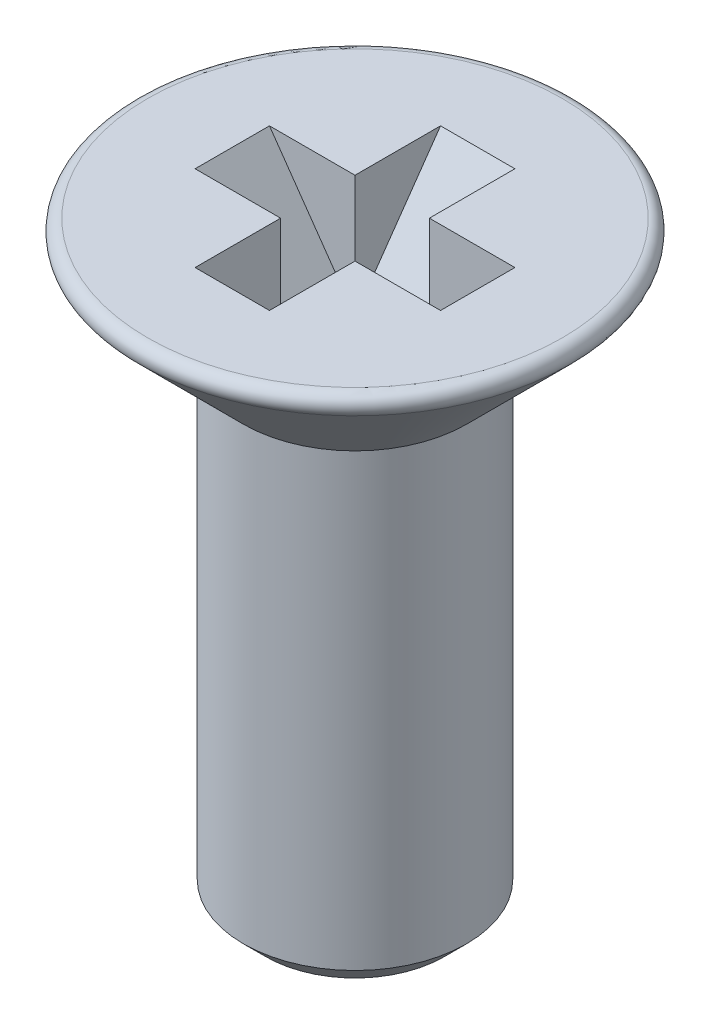
ISO-10303-21;
HEADER;
FILE_DESCRIPTION(('STEP AP214'),'2;1');
FILE_NAME('part.step','',(''),(''),'','','');
FILE_SCHEMA(('AUTOMOTIVE_DESIGN { 1 0 10303 214 1 1 1 1 }'));
ENDSEC;
DATA;
#1=APPLICATION_CONTEXT('core data for automotive mechanical design processes');
#2=APPLICATION_PROTOCOL_DEFINITION('international standard','automotive_design',2000,#1);
#3=PRODUCT_CONTEXT('',#1,'mechanical');
#4=PRODUCT('Part','Part','',(#3));
#5=PRODUCT_RELATED_PRODUCT_CATEGORY('part','',(#4));
#6=PRODUCT_DEFINITION_FORMATION('','',#4);
#7=PRODUCT_DEFINITION_CONTEXT('part definition',#1,'design');
#8=PRODUCT_DEFINITION('design','',#6,#7);
#9=PRODUCT_DEFINITION_SHAPE('','',#8);
#10=(LENGTH_UNIT() NAMED_UNIT(*) SI_UNIT(.MILLI.,.METRE.));
#11=(NAMED_UNIT(*) PLANE_ANGLE_UNIT() SI_UNIT($,.RADIAN.));
#12=(NAMED_UNIT(*) SI_UNIT($,.STERADIAN.) SOLID_ANGLE_UNIT());
#13=UNCERTAINTY_MEASURE_WITH_UNIT(LENGTH_MEASURE(1.E-05),#10,'distance_accuracy_value','');
#14=(GEOMETRIC_REPRESENTATION_CONTEXT(3) GLOBAL_UNCERTAINTY_ASSIGNED_CONTEXT((#13)) GLOBAL_UNIT_ASSIGNED_CONTEXT((#10,
#11,#12)) REPRESENTATION_CONTEXT('',''));
#15=CARTESIAN_POINT('',(0.,0.,0.));
#16=DIRECTION('',(0.,0.,1.));
#17=DIRECTION('',(1.,0.,0.));
#18=AXIS2_PLACEMENT_3D('',#15,#16,#17);
#19=CARTESIAN_POINT('',(0.,0.,0.));
#20=DIRECTION('',(0.,-1.,0.));
#21=DIRECTION('',(1.,0.,0.));
#22=AXIS2_PLACEMENT_3D('',#19,#20,#21);
#23=PLANE('',#22);
#24=CARTESIAN_POINT('',(0.,0.,0.));
#25=DIRECTION('',(0.,-1.,0.));
#26=DIRECTION('',(1.,0.,0.));
#27=AXIS2_PLACEMENT_3D('',#24,#25,#26);
#28=CIRCLE('',#27,2.78786796564403);
#29=CARTESIAN_POINT('',(2.78786796564403,0.,0.));
#30=VERTEX_POINT('',#29);
#31=EDGE_CURVE('E203',#30,#30,#28,.T.);
#32=ORIENTED_EDGE('',*,*,#31,.F.);
#33=EDGE_LOOP('',(#32));
#34=FACE_BOUND('',#33,.T.);
#35=DIRECTION('',(0.,0.,1.));
#36=VECTOR('',#35,1.);
#37=CARTESIAN_POINT('',(-0.499999999999994,0.,1.65));
#38=LINE('',#37,#36);
#39=CARTESIAN_POINT('',(-0.500000000000006,0.,-1.65));
#40=VERTEX_POINT('',#39);
#41=CARTESIAN_POINT('',(-0.500000000000002,0.,-0.5));
#42=VERTEX_POINT('',#41);
#43=EDGE_CURVE('E138',#40,#42,#38,.T.);
#44=ORIENTED_EDGE('',*,*,#43,.F.);
#45=DIRECTION('',(1.,0.,0.));
#46=VECTOR('',#45,1.);
#47=CARTESIAN_POINT('',(-0.500000000000006,0.,-1.65));
#48=LINE('',#47,#46);
#49=CARTESIAN_POINT('',(0.499999999999994,0.,-1.65));
#50=VERTEX_POINT('',#49);
#51=EDGE_CURVE('E124',#40,#50,#48,.T.);
#52=ORIENTED_EDGE('',*,*,#51,.T.);
#53=DIRECTION('',(0.,0.,1.));
#54=VECTOR('',#53,1.);
#55=CARTESIAN_POINT('',(0.500000000000006,0.,1.65));
#56=LINE('',#55,#54);
#57=CARTESIAN_POINT('',(0.499999999999998,0.,-0.5));
#58=VERTEX_POINT('',#57);
#59=EDGE_CURVE('E156',#50,#58,#56,.T.);
#60=ORIENTED_EDGE('',*,*,#59,.T.);
#61=DIRECTION('',(-1.,0.,0.));
#62=VECTOR('',#61,1.);
#63=CARTESIAN_POINT('',(-1.65,0.,-0.5));
#64=LINE('',#63,#62);
#65=CARTESIAN_POINT('',(1.65,0.,-0.5));
#66=VERTEX_POINT('',#65);
#67=EDGE_CURVE('E177',#66,#58,#64,.T.);
#68=ORIENTED_EDGE('',*,*,#67,.F.);
#69=DIRECTION('',(0.,0.,1.));
#70=VECTOR('',#69,1.);
#71=CARTESIAN_POINT('',(1.65,0.,-0.5));
#72=LINE('',#71,#70);
#73=CARTESIAN_POINT('',(1.65,0.,0.5));
#74=VERTEX_POINT('',#73);
#75=EDGE_CURVE('E187',#66,#74,#72,.T.);
#76=ORIENTED_EDGE('',*,*,#75,.T.);
#77=DIRECTION('',(-1.,0.,0.));
#78=VECTOR('',#77,1.);
#79=CARTESIAN_POINT('',(-1.65,0.,0.5));
#80=LINE('',#79,#78);
#81=CARTESIAN_POINT('',(0.500000000000002,0.,0.5));
#82=VERTEX_POINT('',#81);
#83=EDGE_CURVE('E191',#74,#82,#80,.T.);
#84=ORIENTED_EDGE('',*,*,#83,.T.);
#85=CARTESIAN_POINT('',(0.500000000000006,0.,1.65));
#86=VERTEX_POINT('',#85);
#87=EDGE_CURVE('E57',#82,#86,#56,.T.);
#88=ORIENTED_EDGE('',*,*,#87,.T.);
#89=DIRECTION('',(1.,0.,0.));
#90=VECTOR('',#89,1.);
#91=CARTESIAN_POINT('',(-0.499999999999994,0.,1.65));
#92=LINE('',#91,#90);
#93=CARTESIAN_POINT('',(-0.499999999999994,0.,1.65));
#94=VERTEX_POINT('',#93);
#95=EDGE_CURVE('E133',#94,#86,#92,.T.);
#96=ORIENTED_EDGE('',*,*,#95,.F.);
#97=CARTESIAN_POINT('',(-0.499999999999998,0.,0.5));
#98=VERTEX_POINT('',#97);
#99=EDGE_CURVE('E143',#98,#94,#38,.T.);
#100=ORIENTED_EDGE('',*,*,#99,.F.);
#101=CARTESIAN_POINT('',(-1.65,0.,0.5));
#102=VERTEX_POINT('',#101);
#103=EDGE_CURVE('E190',#98,#102,#80,.T.);
#104=ORIENTED_EDGE('',*,*,#103,.T.);
#105=DIRECTION('',(0.,0.,1.));
#106=VECTOR('',#105,1.);
#107=CARTESIAN_POINT('',(-1.65,0.,-0.5));
#108=LINE('',#107,#106);
#109=CARTESIAN_POINT('',(-1.65,0.,-0.5));
#110=VERTEX_POINT('',#109);
#111=EDGE_CURVE('E206',#110,#102,#108,.T.);
#112=ORIENTED_EDGE('',*,*,#111,.F.);
#113=EDGE_CURVE('E148',#42,#110,#64,.T.);
#114=ORIENTED_EDGE('',*,*,#113,.F.);
#115=EDGE_LOOP('',(#44,#52,#60,#68,#76,#84,#88,#96,#100,#104,#112,#114));
#116=FACE_BOUND('',#115,.T.);
#117=ADVANCED_FACE('F34',(#34,#116),#23,.F.);
#118=CARTESIAN_POINT('',(0.,-2.35644421112447,-0.5));
#119=DIRECTION('',(0.,0.,1.));
#120=DIRECTION('',(1.,0.,0.));
#121=AXIS2_PLACEMENT_3D('',#118,#119,#120);
#122=PLANE('',#121);
#123=DIRECTION('',(1.,0.,0.));
#124=VECTOR('',#123,1.);
#125=CARTESIAN_POINT('',(0.544409150195185,-1.57894736842105,-0.5));
#126=LINE('',#125,#124);
#127=CARTESIAN_POINT('',(-0.544409150195185,-1.57894736842105,-0.5));
#128=VERTEX_POINT('',#127);
#129=CARTESIAN_POINT('',(-0.500000000000002,-1.57894736842105,-0.5));
#130=VERTEX_POINT('',#129);
#131=EDGE_CURVE('E184',#128,#130,#126,.T.);
#132=ORIENTED_EDGE('',*,*,#131,.T.);
#133=DIRECTION('',(0.,1.,0.));
#134=VECTOR('',#133,1.);
#135=CARTESIAN_POINT('',(-0.500000000000001,-2.35644421112447,-0.5));
#136=LINE('',#135,#134);
#137=EDGE_CURVE('E170',#130,#42,#136,.T.);
#138=ORIENTED_EDGE('',*,*,#137,.T.);
#139=ORIENTED_EDGE('',*,*,#113,.T.);
#140=DIRECTION('',(0.57357643635105,-0.819152044288989,0.));
#141=VECTOR('',#140,1.);
#142=CARTESIAN_POINT('',(-1.65,0.,-0.5));
#143=LINE('',#142,#141);
#144=EDGE_CURVE('E180',#110,#128,#143,.T.);
#145=ORIENTED_EDGE('',*,*,#144,.T.);
#146=EDGE_LOOP('',(#132,#138,#139,#145));
#147=FACE_BOUND('',#146,.T.);
#148=ADVANCED_FACE('F258',(#147),#122,.T.);
#149=CARTESIAN_POINT('',(0.,-2.35644421112447,0.5));
#150=DIRECTION('',(0.,0.,1.));
#151=DIRECTION('',(1.,0.,0.));
#152=AXIS2_PLACEMENT_3D('',#149,#150,#151);
#153=PLANE('',#152);
#154=DIRECTION('',(0.,1.,0.));
#155=VECTOR('',#154,1.);
#156=CARTESIAN_POINT('',(-0.499999999999998,-2.35644421112447,0.5));
#157=LINE('',#156,#155);
#158=CARTESIAN_POINT('',(-0.499999999999998,-1.57894736842105,0.5));
#159=VERTEX_POINT('',#158);
#160=EDGE_CURVE('E11',#159,#98,#157,.T.);
#161=ORIENTED_EDGE('',*,*,#160,.F.);
#162=DIRECTION('',(1.,0.,0.));
#163=VECTOR('',#162,1.);
#164=CARTESIAN_POINT('',(0.544409150195185,-1.57894736842105,0.5));
#165=LINE('',#164,#163);
#166=CARTESIAN_POINT('',(-0.544409150195185,-1.57894736842105,0.5));
#167=VERTEX_POINT('',#166);
#168=EDGE_CURVE('E176',#167,#159,#165,.T.);
#169=ORIENTED_EDGE('',*,*,#168,.F.);
#170=DIRECTION('',(0.57357643635105,-0.819152044288989,0.));
#171=VECTOR('',#170,1.);
#172=CARTESIAN_POINT('',(-1.65,0.,0.5));
#173=LINE('',#172,#171);
#174=EDGE_CURVE('E194',#102,#167,#173,.T.);
#175=ORIENTED_EDGE('',*,*,#174,.F.);
#176=ORIENTED_EDGE('',*,*,#103,.F.);
#177=EDGE_LOOP('',(#161,#169,#175,#176));
#178=FACE_BOUND('',#177,.T.);
#179=ADVANCED_FACE('F251',(#178),#153,.F.);
#180=CARTESIAN_POINT('',(-1.2,-8.,0.));
#181=DIRECTION('',(0.,1.,0.));
#182=DIRECTION('',(-1.,0.,0.));
#183=AXIS2_PLACEMENT_3D('',#180,#181,#182);
#184=PLANE('',#183);
#185=CARTESIAN_POINT('',(0.,-8.,0.));
#186=DIRECTION('',(0.,-1.,0.));
#187=DIRECTION('',(1.,0.,0.));
#188=AXIS2_PLACEMENT_3D('',#185,#186,#187);
#189=CIRCLE('',#188,1.2);
#190=CARTESIAN_POINT('',(1.2,-8.,0.));
#191=VERTEX_POINT('',#190);
#192=EDGE_CURVE('E222',#191,#191,#189,.T.);
#193=ORIENTED_EDGE('',*,*,#192,.T.);
#194=EDGE_LOOP('',(#193));
#195=FACE_BOUND('',#194,.T.);
#196=ADVANCED_FACE('F36',(#195),#184,.F.);
#197=CARTESIAN_POINT('',(0.,-7.7,0.));
#198=DIRECTION('',(0.,1.,0.));
#199=DIRECTION('',(-1.,0.,0.));
#200=AXIS2_PLACEMENT_3D('',#197,#198,#199);
#201=CONICAL_SURFACE('',#200,1.5,0.785398163397448);
#202=ORIENTED_EDGE('',*,*,#192,.F.);
#203=EDGE_LOOP('',(#202));
#204=FACE_BOUND('',#203,.T.);
#205=CARTESIAN_POINT('',(0.,-7.7,0.));
#206=DIRECTION('',(0.,-1.,0.));
#207=DIRECTION('',(1.,0.,0.));
#208=AXIS2_PLACEMENT_3D('',#205,#206,#207);
#209=CIRCLE('',#208,1.5);
#210=CARTESIAN_POINT('',(1.5,-7.7,0.));
#211=VERTEX_POINT('',#210);
#212=EDGE_CURVE('E219',#211,#211,#209,.T.);
#213=ORIENTED_EDGE('',*,*,#212,.T.);
#214=EDGE_LOOP('',(#213));
#215=FACE_BOUND('',#214,.T.);
#216=ADVANCED_FACE('F290',(#204,#215),#201,.T.);
#217=CARTESIAN_POINT('',(0.,-8.,0.));
#218=DIRECTION('',(0.,-1.,0.));
#219=DIRECTION('',(1.,0.,0.));
#220=AXIS2_PLACEMENT_3D('',#217,#218,#219);
#221=CYLINDRICAL_SURFACE('',#220,1.5);
#222=ORIENTED_EDGE('',*,*,#212,.F.);
#223=EDGE_LOOP('',(#222));
#224=FACE_BOUND('',#223,.T.);
#225=CARTESIAN_POINT('',(0.,-1.64999999999996,0.));
#226=DIRECTION('',(0.,-1.,0.));
#227=DIRECTION('',(1.,0.,0.));
#228=AXIS2_PLACEMENT_3D('',#225,#226,#227);
#229=CIRCLE('',#228,1.5);
#230=CARTESIAN_POINT('',(1.5,-1.64999999999996,0.));
#231=VERTEX_POINT('',#230);
#232=EDGE_CURVE('E216',#231,#231,#229,.T.);
#233=ORIENTED_EDGE('',*,*,#232,.T.);
#234=EDGE_LOOP('',(#233));
#235=FACE_BOUND('',#234,.T.);
#236=ADVANCED_FACE('F287',(#224,#235),#221,.T.);
#237=CARTESIAN_POINT('',(0.,-0.256066017177984,0.));
#238=DIRECTION('',(0.,1.,0.));
#239=DIRECTION('',(-1.,0.,0.));
#240=AXIS2_PLACEMENT_3D('',#237,#238,#239);
#241=CONICAL_SURFACE('',#240,2.89393398282201,0.785398163397461);
#242=ORIENTED_EDGE('',*,*,#232,.F.);
#243=EDGE_LOOP('',(#242));
#244=FACE_BOUND('',#243,.T.);
#245=CARTESIAN_POINT('',(0.,-0.256066017177984,0.));
#246=DIRECTION('',(0.,-1.,0.));
#247=DIRECTION('',(1.,0.,0.));
#248=AXIS2_PLACEMENT_3D('',#245,#246,#247);
#249=CIRCLE('',#248,2.89393398282201);
#250=CARTESIAN_POINT('',(2.89393398282201,-0.256066017177984,0.));
#251=VERTEX_POINT('',#250);
#252=EDGE_CURVE('E213',#251,#251,#249,.T.);
#253=ORIENTED_EDGE('',*,*,#252,.T.);
#254=EDGE_LOOP('',(#253));
#255=FACE_BOUND('',#254,.T.);
#256=ADVANCED_FACE('F283',(#244,#255),#241,.T.);
#257=CARTESIAN_POINT('',(0.,-0.15,0.));
#258=DIRECTION('',(0.,-1.,0.));
#259=DIRECTION('',(1.,0.,0.));
#260=AXIS2_PLACEMENT_3D('',#257,#258,#259);
#261=TOROIDAL_SURFACE('',#260,2.78786796564403,0.15);
#262=ORIENTED_EDGE('',*,*,#252,.F.);
#263=EDGE_LOOP('',(#262));
#264=FACE_BOUND('',#263,.T.);
#265=ORIENTED_EDGE('',*,*,#31,.T.);
#266=EDGE_LOOP('',(#265));
#267=FACE_BOUND('',#266,.T.);
#268=ADVANCED_FACE('F280',(#264,#267),#261,.T.);
#269=CARTESIAN_POINT('',(1.65,0.,-0.5));
#270=DIRECTION('',(0.819152044288989,-0.57357643635105,0.));
#271=DIRECTION('',(0.57357643635105,0.819152044288989,0.));
#272=AXIS2_PLACEMENT_3D('',#269,#270,#271);
#273=PLANE('',#272);
#274=DIRECTION('',(0.57357643635105,0.819152044288989,0.));
#275=VECTOR('',#274,1.);
#276=CARTESIAN_POINT('',(1.65,0.,0.5));
#277=LINE('',#276,#275);
#278=CARTESIAN_POINT('',(0.544409150195185,-1.57894736842105,0.5));
#279=VERTEX_POINT('',#278);
#280=EDGE_CURVE('E172',#279,#74,#277,.T.);
#281=ORIENTED_EDGE('',*,*,#280,.T.);
#282=ORIENTED_EDGE('',*,*,#75,.F.);
#283=DIRECTION('',(0.57357643635105,0.819152044288989,0.));
#284=VECTOR('',#283,1.);
#285=CARTESIAN_POINT('',(1.65,0.,-0.5));
#286=LINE('',#285,#284);
#287=CARTESIAN_POINT('',(0.544409150195185,-1.57894736842105,-0.5));
#288=VERTEX_POINT('',#287);
#289=EDGE_CURVE('E173',#288,#66,#286,.T.);
#290=ORIENTED_EDGE('',*,*,#289,.F.);
#291=DIRECTION('',(0.,0.,1.));
#292=VECTOR('',#291,1.);
#293=CARTESIAN_POINT('',(0.544409150195185,-1.57894736842105,-0.5));
#294=LINE('',#293,#292);
#295=EDGE_CURVE('E200',#288,#279,#294,.T.);
#296=ORIENTED_EDGE('',*,*,#295,.T.);
#297=EDGE_LOOP('',(#281,#282,#290,#296));
#298=FACE_BOUND('',#297,.T.);
#299=ADVANCED_FACE('F233',(#298),#273,.F.);
#300=CARTESIAN_POINT('',(0.544409150195185,-1.57894736842105,-0.5));
#301=DIRECTION('',(0.,-1.,0.));
#302=DIRECTION('',(0.,0.,-1.));
#303=AXIS2_PLACEMENT_3D('',#300,#301,#302);
#304=PLANE('',#303);
#305=CARTESIAN_POINT('',(0.499999999999998,-1.57894736842105,-0.5));
#306=VERTEX_POINT('',#305);
#307=EDGE_CURVE('E183',#306,#288,#126,.T.);
#308=ORIENTED_EDGE('',*,*,#307,.F.);
#309=DIRECTION('',(0.,0.,-1.));
#310=VECTOR('',#309,1.);
#311=CARTESIAN_POINT('',(0.499999999999998,-1.57894736842105,-0.544409150195186));
#312=LINE('',#311,#310);
#313=CARTESIAN_POINT('',(0.499999999999998,-1.57894736842105,-0.544409150195186));
#314=VERTEX_POINT('',#313);
#315=EDGE_CURVE('E49',#306,#314,#312,.T.);
#316=ORIENTED_EDGE('',*,*,#315,.T.);
#317=DIRECTION('',(1.,0.,0.));
#318=VECTOR('',#317,1.);
#319=CARTESIAN_POINT('',(-0.500000000000002,-1.57894736842105,-0.544409150195183));
#320=LINE('',#319,#318);
#321=CARTESIAN_POINT('',(-0.500000000000002,-1.57894736842105,-0.544409150195183));
#322=VERTEX_POINT('',#321);
#323=EDGE_CURVE('E163',#322,#314,#320,.T.);
#324=ORIENTED_EDGE('',*,*,#323,.F.);
#325=DIRECTION('',(0.,0.,-1.));
#326=VECTOR('',#325,1.);
#327=CARTESIAN_POINT('',(-0.500000000000002,-1.57894736842105,-0.544409150195183));
#328=LINE('',#327,#326);
#329=EDGE_CURVE('E141',#130,#322,#328,.T.);
#330=ORIENTED_EDGE('',*,*,#329,.F.);
#331=ORIENTED_EDGE('',*,*,#131,.F.);
#332=DIRECTION('',(0.,0.,1.));
#333=VECTOR('',#332,1.);
#334=CARTESIAN_POINT('',(-0.544409150195185,-1.57894736842105,-0.5));
#335=LINE('',#334,#333);
#336=EDGE_CURVE('E204',#128,#167,#335,.T.);
#337=ORIENTED_EDGE('',*,*,#336,.T.);
#338=ORIENTED_EDGE('',*,*,#168,.T.);
#339=CARTESIAN_POINT('',(-0.499999999999998,-1.57894736842105,0.544409150195187));
#340=VERTEX_POINT('',#339);
#341=EDGE_CURVE('E134',#340,#159,#328,.T.);
#342=ORIENTED_EDGE('',*,*,#341,.F.);
#343=DIRECTION('',(1.,0.,0.));
#344=VECTOR('',#343,1.);
#345=CARTESIAN_POINT('',(-0.499999999999998,-1.57894736842105,0.544409150195187));
#346=LINE('',#345,#344);
#347=CARTESIAN_POINT('',(0.500000000000002,-1.57894736842105,0.544409150195183));
#348=VERTEX_POINT('',#347);
#349=EDGE_CURVE('E166',#340,#348,#346,.T.);
#350=ORIENTED_EDGE('',*,*,#349,.T.);
#351=CARTESIAN_POINT('',(0.500000000000002,-1.57894736842105,0.5));
#352=VERTEX_POINT('',#351);
#353=EDGE_CURVE('E144',#348,#352,#312,.T.);
#354=ORIENTED_EDGE('',*,*,#353,.T.);
#355=EDGE_CURVE('E197',#352,#279,#165,.T.);
#356=ORIENTED_EDGE('',*,*,#355,.T.);
#357=ORIENTED_EDGE('',*,*,#295,.F.);
#358=EDGE_LOOP('',(#308,#316,#324,#330,#331,#337,#338,#342,#350,#354,#356,#357));
#359=FACE_BOUND('',#358,.T.);
#360=ADVANCED_FACE('F239',(#359),#304,.F.);
#361=CARTESIAN_POINT('',(-1.65,0.,-0.5));
#362=DIRECTION('',(-0.819152044288989,-0.57357643635105,0.));
#363=DIRECTION('',(0.57357643635105,-0.819152044288989,0.));
#364=AXIS2_PLACEMENT_3D('',#361,#362,#363);
#365=PLANE('',#364);
#366=ORIENTED_EDGE('',*,*,#174,.T.);
#367=ORIENTED_EDGE('',*,*,#336,.F.);
#368=ORIENTED_EDGE('',*,*,#144,.F.);
#369=ORIENTED_EDGE('',*,*,#111,.T.);
#370=EDGE_LOOP('',(#366,#367,#368,#369));
#371=FACE_BOUND('',#370,.T.);
#372=ADVANCED_FACE('F255',(#371),#365,.F.);
#373=DIRECTION('',(0.,1.,0.));
#374=VECTOR('',#373,1.);
#375=CARTESIAN_POINT('',(0.499999999999999,-2.35644421112447,-0.5));
#376=LINE('',#375,#374);
#377=EDGE_CURVE('E165',#306,#58,#376,.T.);
#378=ORIENTED_EDGE('',*,*,#377,.F.);
#379=ORIENTED_EDGE('',*,*,#307,.T.);
#380=ORIENTED_EDGE('',*,*,#289,.T.);
#381=ORIENTED_EDGE('',*,*,#67,.T.);
#382=EDGE_LOOP('',(#378,#379,#380,#381));
#383=FACE_BOUND('',#382,.T.);
#384=ADVANCED_FACE('F235',(#383),#122,.T.);
#385=ORIENTED_EDGE('',*,*,#355,.F.);
#386=DIRECTION('',(0.,1.,0.));
#387=VECTOR('',#386,1.);
#388=CARTESIAN_POINT('',(0.500000000000002,-2.35644421112447,0.5));
#389=LINE('',#388,#387);
#390=EDGE_CURVE('E42',#352,#82,#389,.T.);
#391=ORIENTED_EDGE('',*,*,#390,.T.);
#392=ORIENTED_EDGE('',*,*,#83,.F.);
#393=ORIENTED_EDGE('',*,*,#280,.F.);
#394=EDGE_LOOP('',(#385,#391,#392,#393));
#395=FACE_BOUND('',#394,.T.);
#396=ADVANCED_FACE('F226',(#395),#153,.F.);
#397=CARTESIAN_POINT('',(0.5,-2.35644421112447,0.));
#398=DIRECTION('',(1.,0.,0.));
#399=DIRECTION('',(0.,0.,-1.));
#400=AXIS2_PLACEMENT_3D('',#397,#398,#399);
#401=PLANE('',#400);
#402=ORIENTED_EDGE('',*,*,#353,.F.);
#403=DIRECTION('',(0.,-0.819152044288989,-0.57357643635105));
#404=VECTOR('',#403,1.);
#405=CARTESIAN_POINT('',(0.500000000000006,0.,1.65));
#406=LINE('',#405,#404);
#407=EDGE_CURVE('E158',#86,#348,#406,.T.);
#408=ORIENTED_EDGE('',*,*,#407,.F.);
#409=ORIENTED_EDGE('',*,*,#87,.F.);
#410=ORIENTED_EDGE('',*,*,#390,.F.);
#411=EDGE_LOOP('',(#402,#408,#409,#410));
#412=FACE_BOUND('',#411,.T.);
#413=ADVANCED_FACE('F241',(#412),#401,.F.);
#414=CARTESIAN_POINT('',(-0.5,-2.35644421112447,0.));
#415=DIRECTION('',(1.,0.,0.));
#416=DIRECTION('',(0.,0.,-1.));
#417=AXIS2_PLACEMENT_3D('',#414,#415,#416);
#418=PLANE('',#417);
#419=ORIENTED_EDGE('',*,*,#160,.T.);
#420=ORIENTED_EDGE('',*,*,#99,.T.);
#421=DIRECTION('',(0.,-0.819152044288989,-0.57357643635105));
#422=VECTOR('',#421,1.);
#423=CARTESIAN_POINT('',(-0.499999999999994,0.,1.65));
#424=LINE('',#423,#422);
#425=EDGE_CURVE('E149',#94,#340,#424,.T.);
#426=ORIENTED_EDGE('',*,*,#425,.T.);
#427=ORIENTED_EDGE('',*,*,#341,.T.);
#428=EDGE_LOOP('',(#419,#420,#426,#427));
#429=FACE_BOUND('',#428,.T.);
#430=ADVANCED_FACE('F266',(#429),#418,.T.);
#431=CARTESIAN_POINT('',(-0.499999999999994,0.,1.65));
#432=DIRECTION('',(0.,-0.57357643635105,0.819152044288989));
#433=DIRECTION('',(0.,-0.819152044288989,-0.57357643635105));
#434=AXIS2_PLACEMENT_3D('',#431,#432,#433);
#435=PLANE('',#434);
#436=ORIENTED_EDGE('',*,*,#407,.T.);
#437=ORIENTED_EDGE('',*,*,#349,.F.);
#438=ORIENTED_EDGE('',*,*,#425,.F.);
#439=ORIENTED_EDGE('',*,*,#95,.T.);
#440=EDGE_LOOP('',(#436,#437,#438,#439));
#441=FACE_BOUND('',#440,.T.);
#442=ADVANCED_FACE('F243',(#441),#435,.F.);
#443=CARTESIAN_POINT('',(-0.500000000000006,0.,-1.65));
#444=DIRECTION('',(0.,-0.57357643635105,-0.819152044288989));
#445=DIRECTION('',(0.,0.819152044288989,-0.57357643635105));
#446=AXIS2_PLACEMENT_3D('',#443,#444,#445);
#447=PLANE('',#446);
#448=DIRECTION('',(0.,0.819152044288989,-0.57357643635105));
#449=VECTOR('',#448,1.);
#450=CARTESIAN_POINT('',(0.499999999999994,0.,-1.65));
#451=LINE('',#450,#449);
#452=EDGE_CURVE('E129',#314,#50,#451,.T.);
#453=ORIENTED_EDGE('',*,*,#452,.T.);
#454=ORIENTED_EDGE('',*,*,#51,.F.);
#455=DIRECTION('',(0.,0.819152044288989,-0.57357643635105));
#456=VECTOR('',#455,1.);
#457=CARTESIAN_POINT('',(-0.500000000000006,0.,-1.65));
#458=LINE('',#457,#456);
#459=EDGE_CURVE('E128',#322,#40,#458,.T.);
#460=ORIENTED_EDGE('',*,*,#459,.F.);
#461=ORIENTED_EDGE('',*,*,#323,.T.);
#462=EDGE_LOOP('',(#453,#454,#460,#461));
#463=FACE_BOUND('',#462,.T.);
#464=ADVANCED_FACE('F126',(#463),#447,.F.);
#465=ORIENTED_EDGE('',*,*,#329,.T.);
#466=ORIENTED_EDGE('',*,*,#459,.T.);
#467=ORIENTED_EDGE('',*,*,#43,.T.);
#468=ORIENTED_EDGE('',*,*,#137,.F.);
#469=EDGE_LOOP('',(#465,#466,#467,#468));
#470=FACE_BOUND('',#469,.T.);
#471=ADVANCED_FACE('F137',(#470),#418,.T.);
#472=ORIENTED_EDGE('',*,*,#377,.T.);
#473=ORIENTED_EDGE('',*,*,#59,.F.);
#474=ORIENTED_EDGE('',*,*,#452,.F.);
#475=ORIENTED_EDGE('',*,*,#315,.F.);
#476=EDGE_LOOP('',(#472,#473,#474,#475));
#477=FACE_BOUND('',#476,.T.);
#478=ADVANCED_FACE('F259',(#477),#401,.F.);
#479=CLOSED_SHELL('',(#117,#148,#179,#196,#216,#236,#256,#268,#299,#360,#372,#384,#396,#413,
#430,#442,#464,#471,#478));
#480=MANIFOLD_SOLID_BREP('B2',#479);
#481=ADVANCED_BREP_SHAPE_REPRESENTATION('',(#18,#480),#14);
#482=SHAPE_DEFINITION_REPRESENTATION(#9,#481);
ENDSEC;
END-ISO-10303-21;
